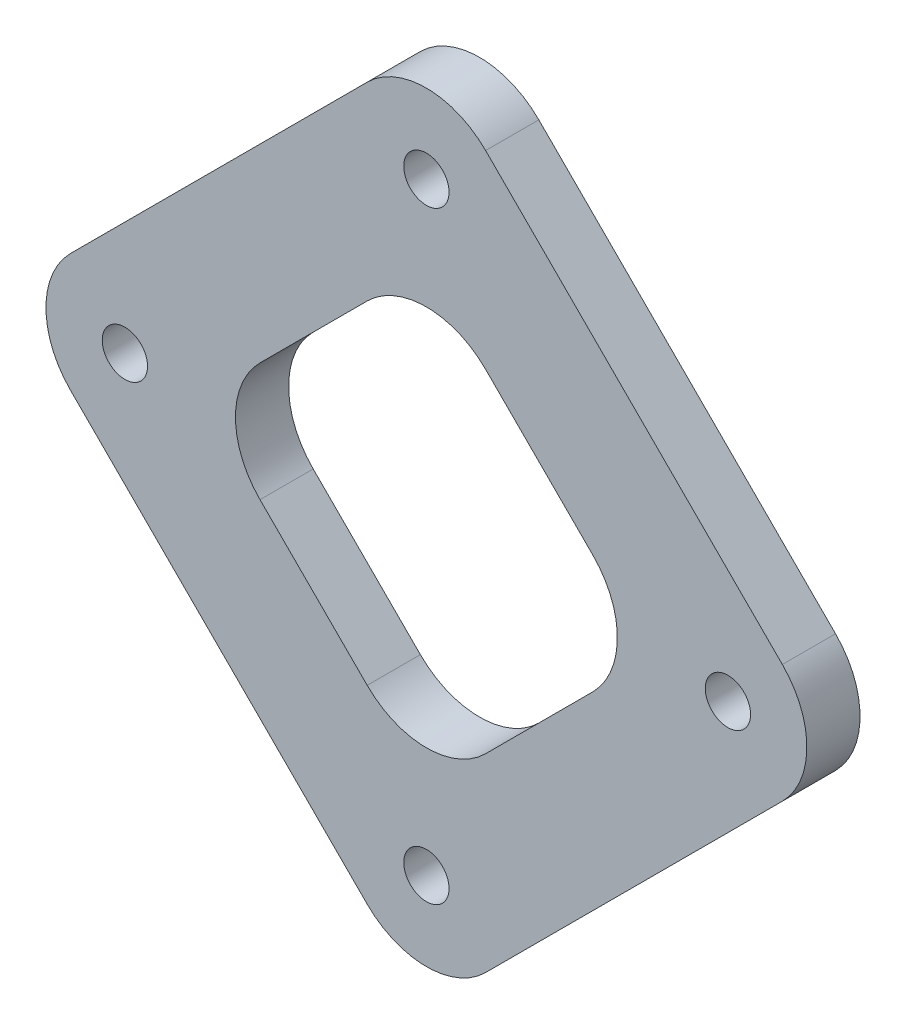
ISO-10303-21;
HEADER;
FILE_DESCRIPTION(('STEP AP214'),'2;1');
FILE_NAME('part.step','',(''),(''),'','','');
FILE_SCHEMA(('AUTOMOTIVE_DESIGN { 1 0 10303 214 1 1 1 1 }'));
ENDSEC;
DATA;
#1=APPLICATION_CONTEXT('core data for automotive mechanical design processes');
#2=APPLICATION_PROTOCOL_DEFINITION('international standard','automotive_design',2000,#1);
#3=PRODUCT_CONTEXT('',#1,'mechanical');
#4=PRODUCT('Part','Part','',(#3));
#5=PRODUCT_RELATED_PRODUCT_CATEGORY('part','',(#4));
#6=PRODUCT_DEFINITION_FORMATION('','',#4);
#7=PRODUCT_DEFINITION_CONTEXT('part definition',#1,'design');
#8=PRODUCT_DEFINITION('design','',#6,#7);
#9=PRODUCT_DEFINITION_SHAPE('','',#8);
#10=(LENGTH_UNIT() NAMED_UNIT(*) SI_UNIT(.MILLI.,.METRE.));
#11=(NAMED_UNIT(*) PLANE_ANGLE_UNIT() SI_UNIT($,.RADIAN.));
#12=(NAMED_UNIT(*) SI_UNIT($,.STERADIAN.) SOLID_ANGLE_UNIT());
#13=UNCERTAINTY_MEASURE_WITH_UNIT(LENGTH_MEASURE(1.E-05),#10,'distance_accuracy_value','');
#14=(GEOMETRIC_REPRESENTATION_CONTEXT(3) GLOBAL_UNCERTAINTY_ASSIGNED_CONTEXT((#13)) GLOBAL_UNIT_ASSIGNED_CONTEXT((#10,
#11,#12)) REPRESENTATION_CONTEXT('',''));
#15=CARTESIAN_POINT('',(0.,0.,0.));
#16=DIRECTION('',(0.,0.,1.));
#17=DIRECTION('',(1.,0.,0.));
#18=AXIS2_PLACEMENT_3D('',#15,#16,#17);
#19=CARTESIAN_POINT('',(0.,0.,3.175));
#20=DIRECTION('',(0.,0.,1.));
#21=DIRECTION('',(1.,0.,0.));
#22=AXIS2_PLACEMENT_3D('',#19,#20,#21);
#23=PLANE('',#22);
#24=CARTESIAN_POINT('',(18.,0.,3.175));
#25=DIRECTION('',(0.,0.,1.));
#26=DIRECTION('',(1.,0.,0.));
#27=AXIS2_PLACEMENT_3D('',#24,#25,#26);
#28=CIRCLE('',#27,1.35254999999999);
#29=CARTESIAN_POINT('',(19.35255,0.,3.175));
#30=VERTEX_POINT('',#29);
#31=EDGE_CURVE('E351',#30,#30,#28,.T.);
#32=ORIENTED_EDGE('',*,*,#31,.F.);
#33=EDGE_LOOP('',(#32));
#34=FACE_BOUND('',#33,.T.);
#35=CARTESIAN_POINT('',(0.,18.,3.175));
#36=DIRECTION('',(0.,0.,1.));
#37=DIRECTION('',(1.,0.,0.));
#38=AXIS2_PLACEMENT_3D('',#35,#36,#37);
#39=CIRCLE('',#38,1.35254999999999);
#40=CARTESIAN_POINT('',(1.35254999999999,18.,3.175));
#41=VERTEX_POINT('',#40);
#42=EDGE_CURVE('E212',#41,#41,#39,.T.);
#43=ORIENTED_EDGE('',*,*,#42,.F.);
#44=EDGE_LOOP('',(#43));
#45=FACE_BOUND('',#44,.T.);
#46=CARTESIAN_POINT('',(0.,-18.,3.175));
#47=DIRECTION('',(0.,0.,1.));
#48=DIRECTION('',(1.,0.,0.));
#49=AXIS2_PLACEMENT_3D('',#46,#47,#48);
#50=CIRCLE('',#49,1.35254999999999);
#51=CARTESIAN_POINT('',(1.35254999999999,-18.,3.175));
#52=VERTEX_POINT('',#51);
#53=EDGE_CURVE('E362',#52,#52,#50,.T.);
#54=ORIENTED_EDGE('',*,*,#53,.F.);
#55=EDGE_LOOP('',(#54));
#56=FACE_BOUND('',#55,.T.);
#57=CARTESIAN_POINT('',(-18.,0.,3.175));
#58=DIRECTION('',(0.,0.,1.));
#59=DIRECTION('',(1.,0.,0.));
#60=AXIS2_PLACEMENT_3D('',#57,#58,#59);
#61=CIRCLE('',#60,1.35254999999999);
#62=CARTESIAN_POINT('',(-16.64745,0.,3.175));
#63=VERTEX_POINT('',#62);
#64=EDGE_CURVE('E171',#63,#63,#61,.T.);
#65=ORIENTED_EDGE('',*,*,#64,.F.);
#66=EDGE_LOOP('',(#65));
#67=FACE_BOUND('',#66,.T.);
#68=DIRECTION('',(0.707106781186547,0.707106781186548,0.));
#69=VECTOR('',#68,1.);
#70=CARTESIAN_POINT('',(24.7840926805885,0.,3.175));
#71=LINE('',#70,#69);
#72=CARTESIAN_POINT('',(3.53553390593273,-21.2485587746558,3.175));
#73=VERTEX_POINT('',#72);
#74=CARTESIAN_POINT('',(21.2485587746557,-3.53553390593274,3.175));
#75=VERTEX_POINT('',#74);
#76=EDGE_CURVE('E180',#73,#75,#71,.T.);
#77=ORIENTED_EDGE('',*,*,#76,.T.);
#78=CARTESIAN_POINT('',(17.713024868723,0.,3.175));
#79=DIRECTION('',(0.,0.,1.));
#80=DIRECTION('',(1.,0.,0.));
#81=AXIS2_PLACEMENT_3D('',#78,#79,#80);
#82=CIRCLE('',#81,5.);
#83=CARTESIAN_POINT('',(21.2485587746558,3.53553390593273,3.175));
#84=VERTEX_POINT('',#83);
#85=EDGE_CURVE('E239',#75,#84,#82,.T.);
#86=ORIENTED_EDGE('',*,*,#85,.T.);
#87=DIRECTION('',(-0.707106781186547,0.707106781186548,0.));
#88=VECTOR('',#87,1.);
#89=CARTESIAN_POINT('',(0.,24.7840926805885,3.175));
#90=LINE('',#89,#88);
#91=CARTESIAN_POINT('',(3.53553390593274,21.2485587746558,3.175));
#92=VERTEX_POINT('',#91);
#93=EDGE_CURVE('E175',#84,#92,#90,.T.);
#94=ORIENTED_EDGE('',*,*,#93,.T.);
#95=CARTESIAN_POINT('',(0.,17.713024868723,3.175));
#96=DIRECTION('',(0.,0.,1.));
#97=DIRECTION('',(1.,0.,0.));
#98=AXIS2_PLACEMENT_3D('',#95,#96,#97);
#99=CIRCLE('',#98,5.);
#100=CARTESIAN_POINT('',(-3.53553390593274,21.2485587746558,3.175));
#101=VERTEX_POINT('',#100);
#102=EDGE_CURVE('E234',#92,#101,#99,.T.);
#103=ORIENTED_EDGE('',*,*,#102,.T.);
#104=DIRECTION('',(-0.707106781186548,-0.707106781186548,0.));
#105=VECTOR('',#104,1.);
#106=CARTESIAN_POINT('',(0.,24.7840926805885,3.175));
#107=LINE('',#106,#105);
#108=CARTESIAN_POINT('',(-21.2485587746558,3.53553390593273,3.175));
#109=VERTEX_POINT('',#108);
#110=EDGE_CURVE('E253',#101,#109,#107,.T.);
#111=ORIENTED_EDGE('',*,*,#110,.T.);
#112=CARTESIAN_POINT('',(-17.713024868723,0.,3.175));
#113=DIRECTION('',(0.,0.,1.));
#114=DIRECTION('',(1.,0.,0.));
#115=AXIS2_PLACEMENT_3D('',#112,#113,#114);
#116=CIRCLE('',#115,5.);
#117=CARTESIAN_POINT('',(-21.2485587746558,-3.53553390593274,3.175));
#118=VERTEX_POINT('',#117);
#119=EDGE_CURVE('E57',#109,#118,#116,.T.);
#120=ORIENTED_EDGE('',*,*,#119,.T.);
#121=DIRECTION('',(0.707106781186547,-0.707106781186548,0.));
#122=VECTOR('',#121,1.);
#123=CARTESIAN_POINT('',(-24.7840926805885,0.,3.175));
#124=LINE('',#123,#122);
#125=CARTESIAN_POINT('',(-3.53553390593274,-21.2485587746558,3.175));
#126=VERTEX_POINT('',#125);
#127=EDGE_CURVE('E275',#118,#126,#124,.T.);
#128=ORIENTED_EDGE('',*,*,#127,.T.);
#129=CARTESIAN_POINT('',(0.,-17.713024868723,3.175));
#130=DIRECTION('',(0.,0.,1.));
#131=DIRECTION('',(1.,0.,0.));
#132=AXIS2_PLACEMENT_3D('',#129,#130,#131);
#133=CIRCLE('',#132,5.);
#134=EDGE_CURVE('E237',#126,#73,#133,.T.);
#135=ORIENTED_EDGE('',*,*,#134,.T.);
#136=EDGE_LOOP('',(#77,#86,#94,#103,#111,#120,#128,#135));
#137=FACE_BOUND('',#136,.T.);
#138=DIRECTION('',(0.707106781186547,-0.707106781186548,0.));
#139=VECTOR('',#138,1.);
#140=CARTESIAN_POINT('',(-13.4703841816037,0.,3.175));
#141=LINE('',#140,#139);
#142=CARTESIAN_POINT('',(-9.93485027567099,-3.53553390593274,3.175));
#143=VERTEX_POINT('',#142);
#144=CARTESIAN_POINT('',(-3.53553390593274,-9.934850275671,3.175));
#145=VERTEX_POINT('',#144);
#146=EDGE_CURVE('E372',#143,#145,#141,.T.);
#147=ORIENTED_EDGE('',*,*,#146,.F.);
#148=CARTESIAN_POINT('',(-6.39931636973826,0.,3.175));
#149=DIRECTION('',(0.,0.,1.));
#150=DIRECTION('',(1.,0.,0.));
#151=AXIS2_PLACEMENT_3D('',#148,#149,#150);
#152=CIRCLE('',#151,5.);
#153=CARTESIAN_POINT('',(-9.93485027567099,3.53553390593274,3.175));
#154=VERTEX_POINT('',#153);
#155=EDGE_CURVE('E201',#143,#154,#152,.F.);
#156=ORIENTED_EDGE('',*,*,#155,.T.);
#157=DIRECTION('',(-0.707106781186547,-0.707106781186547,0.));
#158=VECTOR('',#157,1.);
#159=CARTESIAN_POINT('',(0.,13.4703841816037,3.175));
#160=LINE('',#159,#158);
#161=CARTESIAN_POINT('',(-3.53553390593274,9.93485027567099,3.175));
#162=VERTEX_POINT('',#161);
#163=EDGE_CURVE('E370',#162,#154,#160,.T.);
#164=ORIENTED_EDGE('',*,*,#163,.F.);
#165=CARTESIAN_POINT('',(0.,6.39931636973825,3.175));
#166=DIRECTION('',(0.,0.,1.));
#167=DIRECTION('',(1.,0.,0.));
#168=AXIS2_PLACEMENT_3D('',#165,#166,#167);
#169=CIRCLE('',#168,5.);
#170=CARTESIAN_POINT('',(3.53553390593274,9.93485027567099,3.175));
#171=VERTEX_POINT('',#170);
#172=EDGE_CURVE('E159',#162,#171,#169,.F.);
#173=ORIENTED_EDGE('',*,*,#172,.T.);
#174=DIRECTION('',(-0.707106781186547,0.707106781186548,0.));
#175=VECTOR('',#174,1.);
#176=CARTESIAN_POINT('',(0.,13.4703841816037,3.175));
#177=LINE('',#176,#175);
#178=CARTESIAN_POINT('',(9.93485027567099,3.53553390593274,3.175));
#179=VERTEX_POINT('',#178);
#180=EDGE_CURVE('E261',#179,#171,#177,.T.);
#181=ORIENTED_EDGE('',*,*,#180,.F.);
#182=CARTESIAN_POINT('',(6.39931636973825,0.,3.175));
#183=DIRECTION('',(0.,0.,1.));
#184=DIRECTION('',(1.,0.,0.));
#185=AXIS2_PLACEMENT_3D('',#182,#183,#184);
#186=CIRCLE('',#185,5.);
#187=CARTESIAN_POINT('',(9.93485027567099,-3.53553390593274,3.175));
#188=VERTEX_POINT('',#187);
#189=EDGE_CURVE('E160',#179,#188,#186,.F.);
#190=ORIENTED_EDGE('',*,*,#189,.T.);
#191=DIRECTION('',(0.707106781186547,0.707106781186548,0.));
#192=VECTOR('',#191,1.);
#193=CARTESIAN_POINT('',(13.4703841816037,0.,3.175));
#194=LINE('',#193,#192);
#195=CARTESIAN_POINT('',(3.53553390593274,-9.93485027567099,3.175));
#196=VERTEX_POINT('',#195);
#197=EDGE_CURVE('E266',#196,#188,#194,.T.);
#198=ORIENTED_EDGE('',*,*,#197,.F.);
#199=CARTESIAN_POINT('',(0.,-6.39931636973826,3.175));
#200=DIRECTION('',(0.,0.,1.));
#201=DIRECTION('',(1.,0.,0.));
#202=AXIS2_PLACEMENT_3D('',#199,#200,#201);
#203=CIRCLE('',#202,5.);
#204=EDGE_CURVE('E205',#196,#145,#203,.F.);
#205=ORIENTED_EDGE('',*,*,#204,.T.);
#206=EDGE_LOOP('',(#147,#156,#164,#173,#181,#190,#198,#205));
#207=FACE_BOUND('',#206,.T.);
#208=ADVANCED_FACE('F35',(#34,#45,#56,#67,#137,#207),#23,.T.);
#209=CARTESIAN_POINT('',(0.,0.,0.));
#210=DIRECTION('',(0.,0.,1.));
#211=DIRECTION('',(1.,0.,0.));
#212=AXIS2_PLACEMENT_3D('',#209,#210,#211);
#213=PLANE('',#212);
#214=CARTESIAN_POINT('',(18.,0.,0.));
#215=DIRECTION('',(0.,0.,-1.));
#216=DIRECTION('',(-1.,0.,0.));
#217=AXIS2_PLACEMENT_3D('',#214,#215,#216);
#218=CIRCLE('',#217,1.35254999999999);
#219=CARTESIAN_POINT('',(16.64745,0.,0.));
#220=VERTEX_POINT('',#219);
#221=EDGE_CURVE('E354',#220,#220,#218,.T.);
#222=ORIENTED_EDGE('',*,*,#221,.F.);
#223=EDGE_LOOP('',(#222));
#224=FACE_BOUND('',#223,.T.);
#225=CARTESIAN_POINT('',(0.,18.,0.));
#226=DIRECTION('',(0.,0.,-1.));
#227=DIRECTION('',(-1.,0.,0.));
#228=AXIS2_PLACEMENT_3D('',#225,#226,#227);
#229=CIRCLE('',#228,1.35254999999999);
#230=CARTESIAN_POINT('',(-1.35254999999999,18.,0.));
#231=VERTEX_POINT('',#230);
#232=EDGE_CURVE('E216',#231,#231,#229,.T.);
#233=ORIENTED_EDGE('',*,*,#232,.F.);
#234=EDGE_LOOP('',(#233));
#235=FACE_BOUND('',#234,.T.);
#236=CARTESIAN_POINT('',(0.,-18.,0.));
#237=DIRECTION('',(0.,0.,-1.));
#238=DIRECTION('',(-1.,0.,0.));
#239=AXIS2_PLACEMENT_3D('',#236,#237,#238);
#240=CIRCLE('',#239,1.35254999999999);
#241=CARTESIAN_POINT('',(-1.35254999999999,-18.,0.));
#242=VERTEX_POINT('',#241);
#243=EDGE_CURVE('E215',#242,#242,#240,.T.);
#244=ORIENTED_EDGE('',*,*,#243,.F.);
#245=EDGE_LOOP('',(#244));
#246=FACE_BOUND('',#245,.T.);
#247=CARTESIAN_POINT('',(-18.,0.,0.));
#248=DIRECTION('',(0.,0.,-1.));
#249=DIRECTION('',(-1.,0.,0.));
#250=AXIS2_PLACEMENT_3D('',#247,#248,#249);
#251=CIRCLE('',#250,1.35254999999999);
#252=CARTESIAN_POINT('',(-19.35255,0.,0.));
#253=VERTEX_POINT('',#252);
#254=EDGE_CURVE('E365',#253,#253,#251,.T.);
#255=ORIENTED_EDGE('',*,*,#254,.F.);
#256=EDGE_LOOP('',(#255));
#257=FACE_BOUND('',#256,.T.);
#258=DIRECTION('',(-0.707106781186547,0.707106781186548,0.));
#259=VECTOR('',#258,1.);
#260=CARTESIAN_POINT('',(0.,24.7840926805885,0.));
#261=LINE('',#260,#259);
#262=CARTESIAN_POINT('',(21.2485587746558,3.53553390593273,0.));
#263=VERTEX_POINT('',#262);
#264=CARTESIAN_POINT('',(3.53553390593274,21.2485587746558,0.));
#265=VERTEX_POINT('',#264);
#266=EDGE_CURVE('E183',#263,#265,#261,.T.);
#267=ORIENTED_EDGE('',*,*,#266,.F.);
#268=CARTESIAN_POINT('',(17.713024868723,0.,0.));
#269=DIRECTION('',(0.,0.,1.));
#270=DIRECTION('',(1.,0.,0.));
#271=AXIS2_PLACEMENT_3D('',#268,#269,#270);
#272=CIRCLE('',#271,5.);
#273=CARTESIAN_POINT('',(21.2485587746557,-3.53553390593274,0.));
#274=VERTEX_POINT('',#273);
#275=EDGE_CURVE('E227',#263,#274,#272,.F.);
#276=ORIENTED_EDGE('',*,*,#275,.T.);
#277=DIRECTION('',(0.707106781186547,0.707106781186548,0.));
#278=VECTOR('',#277,1.);
#279=CARTESIAN_POINT('',(24.7840926805885,0.,0.));
#280=LINE('',#279,#278);
#281=CARTESIAN_POINT('',(3.53553390593273,-21.2485587746558,0.));
#282=VERTEX_POINT('',#281);
#283=EDGE_CURVE('E263',#282,#274,#280,.T.);
#284=ORIENTED_EDGE('',*,*,#283,.F.);
#285=CARTESIAN_POINT('',(0.,-17.713024868723,0.));
#286=DIRECTION('',(0.,0.,1.));
#287=DIRECTION('',(1.,0.,0.));
#288=AXIS2_PLACEMENT_3D('',#285,#286,#287);
#289=CIRCLE('',#288,5.);
#290=CARTESIAN_POINT('',(-3.53553390593274,-21.2485587746558,0.));
#291=VERTEX_POINT('',#290);
#292=EDGE_CURVE('E225',#282,#291,#289,.F.);
#293=ORIENTED_EDGE('',*,*,#292,.T.);
#294=DIRECTION('',(0.707106781186547,-0.707106781186548,0.));
#295=VECTOR('',#294,1.);
#296=CARTESIAN_POINT('',(-24.7840926805885,0.,0.));
#297=LINE('',#296,#295);
#298=CARTESIAN_POINT('',(-21.2485587746558,-3.53553390593274,0.));
#299=VERTEX_POINT('',#298);
#300=EDGE_CURVE('E260',#299,#291,#297,.T.);
#301=ORIENTED_EDGE('',*,*,#300,.F.);
#302=CARTESIAN_POINT('',(-17.713024868723,0.,0.));
#303=DIRECTION('',(0.,0.,1.));
#304=DIRECTION('',(1.,0.,0.));
#305=AXIS2_PLACEMENT_3D('',#302,#303,#304);
#306=CIRCLE('',#305,5.);
#307=CARTESIAN_POINT('',(-21.2485587746558,3.53553390593273,0.));
#308=VERTEX_POINT('',#307);
#309=EDGE_CURVE('E223',#299,#308,#306,.F.);
#310=ORIENTED_EDGE('',*,*,#309,.T.);
#311=DIRECTION('',(-0.707106781186548,-0.707106781186548,0.));
#312=VECTOR('',#311,1.);
#313=CARTESIAN_POINT('',(0.,24.7840926805885,0.));
#314=LINE('',#313,#312);
#315=CARTESIAN_POINT('',(-3.53553390593274,21.2485587746558,0.));
#316=VERTEX_POINT('',#315);
#317=EDGE_CURVE('E251',#316,#308,#314,.T.);
#318=ORIENTED_EDGE('',*,*,#317,.F.);
#319=CARTESIAN_POINT('',(0.,17.713024868723,0.));
#320=DIRECTION('',(0.,0.,1.));
#321=DIRECTION('',(1.,0.,0.));
#322=AXIS2_PLACEMENT_3D('',#319,#320,#321);
#323=CIRCLE('',#322,5.);
#324=EDGE_CURVE('E221',#316,#265,#323,.F.);
#325=ORIENTED_EDGE('',*,*,#324,.T.);
#326=EDGE_LOOP('',(#267,#276,#284,#293,#301,#310,#318,#325));
#327=FACE_BOUND('',#326,.T.);
#328=DIRECTION('',(-0.707106781186547,0.707106781186548,0.));
#329=VECTOR('',#328,1.);
#330=CARTESIAN_POINT('',(0.,13.4703841816037,0.));
#331=LINE('',#330,#329);
#332=CARTESIAN_POINT('',(9.93485027567099,3.53553390593274,0.));
#333=VERTEX_POINT('',#332);
#334=CARTESIAN_POINT('',(3.53553390593274,9.93485027567099,0.));
#335=VERTEX_POINT('',#334);
#336=EDGE_CURVE('E154',#333,#335,#331,.T.);
#337=ORIENTED_EDGE('',*,*,#336,.T.);
#338=CARTESIAN_POINT('',(0.,6.39931636973825,0.));
#339=DIRECTION('',(0.,0.,1.));
#340=DIRECTION('',(1.,0.,0.));
#341=AXIS2_PLACEMENT_3D('',#338,#339,#340);
#342=CIRCLE('',#341,5.);
#343=CARTESIAN_POINT('',(-3.53553390593274,9.93485027567099,0.));
#344=VERTEX_POINT('',#343);
#345=EDGE_CURVE('E149',#335,#344,#342,.T.);
#346=ORIENTED_EDGE('',*,*,#345,.T.);
#347=DIRECTION('',(-0.707106781186547,-0.707106781186547,0.));
#348=VECTOR('',#347,1.);
#349=CARTESIAN_POINT('',(0.,13.4703841816037,0.));
#350=LINE('',#349,#348);
#351=CARTESIAN_POINT('',(-9.93485027567099,3.53553390593274,0.));
#352=VERTEX_POINT('',#351);
#353=EDGE_CURVE('E152',#344,#352,#350,.T.);
#354=ORIENTED_EDGE('',*,*,#353,.T.);
#355=CARTESIAN_POINT('',(-6.39931636973826,0.,0.));
#356=DIRECTION('',(0.,0.,1.));
#357=DIRECTION('',(1.,0.,0.));
#358=AXIS2_PLACEMENT_3D('',#355,#356,#357);
#359=CIRCLE('',#358,5.);
#360=CARTESIAN_POINT('',(-9.93485027567099,-3.53553390593274,0.));
#361=VERTEX_POINT('',#360);
#362=EDGE_CURVE('E199',#352,#361,#359,.T.);
#363=ORIENTED_EDGE('',*,*,#362,.T.);
#364=DIRECTION('',(0.707106781186547,-0.707106781186548,0.));
#365=VECTOR('',#364,1.);
#366=CARTESIAN_POINT('',(-13.4703841816037,0.,0.));
#367=LINE('',#366,#365);
#368=CARTESIAN_POINT('',(-3.53553390593274,-9.934850275671,0.));
#369=VERTEX_POINT('',#368);
#370=EDGE_CURVE('E170',#361,#369,#367,.T.);
#371=ORIENTED_EDGE('',*,*,#370,.T.);
#372=CARTESIAN_POINT('',(0.,-6.39931636973826,0.));
#373=DIRECTION('',(0.,0.,1.));
#374=DIRECTION('',(1.,0.,0.));
#375=AXIS2_PLACEMENT_3D('',#372,#373,#374);
#376=CIRCLE('',#375,5.);
#377=CARTESIAN_POINT('',(3.53553390593274,-9.93485027567099,0.));
#378=VERTEX_POINT('',#377);
#379=EDGE_CURVE('E203',#369,#378,#376,.T.);
#380=ORIENTED_EDGE('',*,*,#379,.T.);
#381=DIRECTION('',(0.707106781186547,0.707106781186548,0.));
#382=VECTOR('',#381,1.);
#383=CARTESIAN_POINT('',(13.4703841816037,0.,0.));
#384=LINE('',#383,#382);
#385=CARTESIAN_POINT('',(9.93485027567099,-3.53553390593274,0.));
#386=VERTEX_POINT('',#385);
#387=EDGE_CURVE('E378',#378,#386,#384,.T.);
#388=ORIENTED_EDGE('',*,*,#387,.T.);
#389=CARTESIAN_POINT('',(6.39931636973825,0.,0.));
#390=DIRECTION('',(0.,0.,1.));
#391=DIRECTION('',(1.,0.,0.));
#392=AXIS2_PLACEMENT_3D('',#389,#390,#391);
#393=CIRCLE('',#392,5.);
#394=EDGE_CURVE('E207',#386,#333,#393,.T.);
#395=ORIENTED_EDGE('',*,*,#394,.T.);
#396=EDGE_LOOP('',(#337,#346,#354,#363,#371,#380,#388,#395));
#397=FACE_BOUND('',#396,.T.);
#398=ADVANCED_FACE('F151',(#224,#235,#246,#257,#327,#397),#213,.F.);
#399=CARTESIAN_POINT('',(0.,24.7840926805885,3.175));
#400=DIRECTION('',(0.707106781186548,-0.707106781186548,0.));
#401=DIRECTION('',(0.707106781186548,0.707106781186548,0.));
#402=AXIS2_PLACEMENT_3D('',#399,#400,#401);
#403=PLANE('',#402);
#404=ORIENTED_EDGE('',*,*,#317,.T.);
#405=DIRECTION('',(0.,0.,-1.));
#406=VECTOR('',#405,1.);
#407=CARTESIAN_POINT('',(-21.2485587746558,3.53553390593274,3.175));
#408=LINE('',#407,#406);
#409=EDGE_CURVE('E11',#308,#109,#408,.F.);
#410=ORIENTED_EDGE('',*,*,#409,.T.);
#411=ORIENTED_EDGE('',*,*,#110,.F.);
#412=DIRECTION('',(0.,0.,-1.));
#413=VECTOR('',#412,1.);
#414=CARTESIAN_POINT('',(-3.53553390593274,21.2485587746558,3.175));
#415=LINE('',#414,#413);
#416=EDGE_CURVE('E43',#101,#316,#415,.T.);
#417=ORIENTED_EDGE('',*,*,#416,.T.);
#418=EDGE_LOOP('',(#404,#410,#411,#417));
#419=FACE_BOUND('',#418,.T.);
#420=ADVANCED_FACE('F250',(#419),#403,.F.);
#421=CARTESIAN_POINT('',(-24.7840926805885,0.,3.175));
#422=DIRECTION('',(0.707106781186548,0.707106781186547,0.));
#423=DIRECTION('',(-0.707106781186547,0.707106781186548,0.));
#424=AXIS2_PLACEMENT_3D('',#421,#422,#423);
#425=PLANE('',#424);
#426=ORIENTED_EDGE('',*,*,#300,.T.);
#427=DIRECTION('',(0.,0.,-1.));
#428=VECTOR('',#427,1.);
#429=CARTESIAN_POINT('',(-3.53553390593274,-21.2485587746558,3.175));
#430=LINE('',#429,#428);
#431=EDGE_CURVE('E50',#291,#126,#430,.F.);
#432=ORIENTED_EDGE('',*,*,#431,.T.);
#433=ORIENTED_EDGE('',*,*,#127,.F.);
#434=DIRECTION('',(0.,0.,-1.));
#435=VECTOR('',#434,1.);
#436=CARTESIAN_POINT('',(-21.2485587746558,-3.53553390593274,3.175));
#437=LINE('',#436,#435);
#438=EDGE_CURVE('E241',#118,#299,#437,.T.);
#439=ORIENTED_EDGE('',*,*,#438,.T.);
#440=EDGE_LOOP('',(#426,#432,#433,#439));
#441=FACE_BOUND('',#440,.T.);
#442=ADVANCED_FACE('F292',(#441),#425,.F.);
#443=CARTESIAN_POINT('',(24.7840926805885,0.,3.175));
#444=DIRECTION('',(-0.707106781186548,0.707106781186547,0.));
#445=DIRECTION('',(-0.707106781186547,-0.707106781186548,0.));
#446=AXIS2_PLACEMENT_3D('',#443,#444,#445);
#447=PLANE('',#446);
#448=ORIENTED_EDGE('',*,*,#283,.T.);
#449=DIRECTION('',(0.,0.,-1.));
#450=VECTOR('',#449,1.);
#451=CARTESIAN_POINT('',(21.2485587746557,-3.53553390593274,3.175));
#452=LINE('',#451,#450);
#453=EDGE_CURVE('E232',#274,#75,#452,.F.);
#454=ORIENTED_EDGE('',*,*,#453,.T.);
#455=ORIENTED_EDGE('',*,*,#76,.F.);
#456=DIRECTION('',(0.,0.,-1.));
#457=VECTOR('',#456,1.);
#458=CARTESIAN_POINT('',(3.53553390593274,-21.2485587746558,3.175));
#459=LINE('',#458,#457);
#460=EDGE_CURVE('E229',#73,#282,#459,.T.);
#461=ORIENTED_EDGE('',*,*,#460,.T.);
#462=EDGE_LOOP('',(#448,#454,#455,#461));
#463=FACE_BOUND('',#462,.T.);
#464=ADVANCED_FACE('F295',(#463),#447,.F.);
#465=CARTESIAN_POINT('',(0.,24.7840926805885,3.175));
#466=DIRECTION('',(-0.707106781186548,-0.707106781186547,0.));
#467=DIRECTION('',(0.707106781186547,-0.707106781186548,0.));
#468=AXIS2_PLACEMENT_3D('',#465,#466,#467);
#469=PLANE('',#468);
#470=ORIENTED_EDGE('',*,*,#93,.F.);
#471=DIRECTION('',(0.,0.,-1.));
#472=VECTOR('',#471,1.);
#473=CARTESIAN_POINT('',(21.2485587746558,3.53553390593273,3.175));
#474=LINE('',#473,#472);
#475=EDGE_CURVE('E218',#84,#263,#474,.T.);
#476=ORIENTED_EDGE('',*,*,#475,.T.);
#477=ORIENTED_EDGE('',*,*,#266,.T.);
#478=DIRECTION('',(0.,0.,-1.));
#479=VECTOR('',#478,1.);
#480=CARTESIAN_POINT('',(3.53553390593274,21.2485587746558,3.175));
#481=LINE('',#480,#479);
#482=EDGE_CURVE('E211',#265,#92,#481,.F.);
#483=ORIENTED_EDGE('',*,*,#482,.T.);
#484=EDGE_LOOP('',(#470,#476,#477,#483));
#485=FACE_BOUND('',#484,.T.);
#486=ADVANCED_FACE('F290',(#485),#469,.F.);
#487=CARTESIAN_POINT('',(0.,13.4703841816037,3.175));
#488=DIRECTION('',(0.707106781186548,-0.707106781186548,0.));
#489=DIRECTION('',(0.707106781186548,0.707106781186548,0.));
#490=AXIS2_PLACEMENT_3D('',#487,#488,#489);
#491=PLANE('',#490);
#492=ORIENTED_EDGE('',*,*,#163,.T.);
#493=DIRECTION('',(0.,0.,-1.));
#494=VECTOR('',#493,1.);
#495=CARTESIAN_POINT('',(-9.934850275671,3.53553390593274,0.));
#496=LINE('',#495,#494);
#497=EDGE_CURVE('E169',#154,#352,#496,.T.);
#498=ORIENTED_EDGE('',*,*,#497,.T.);
#499=ORIENTED_EDGE('',*,*,#353,.F.);
#500=DIRECTION('',(0.,0.,-1.));
#501=VECTOR('',#500,1.);
#502=CARTESIAN_POINT('',(-3.53553390593274,9.93485027567099,3.175));
#503=LINE('',#502,#501);
#504=EDGE_CURVE('E166',#344,#162,#503,.F.);
#505=ORIENTED_EDGE('',*,*,#504,.T.);
#506=EDGE_LOOP('',(#492,#498,#499,#505));
#507=FACE_BOUND('',#506,.T.);
#508=ADVANCED_FACE('F165',(#507),#491,.T.);
#509=CARTESIAN_POINT('',(-13.4703841816037,0.,3.175));
#510=DIRECTION('',(0.707106781186548,0.707106781186547,0.));
#511=DIRECTION('',(-0.707106781186547,0.707106781186548,0.));
#512=AXIS2_PLACEMENT_3D('',#509,#510,#511);
#513=PLANE('',#512);
#514=ORIENTED_EDGE('',*,*,#370,.F.);
#515=DIRECTION('',(0.,0.,-1.));
#516=VECTOR('',#515,1.);
#517=CARTESIAN_POINT('',(-9.934850275671,-3.53553390593274,3.175));
#518=LINE('',#517,#516);
#519=EDGE_CURVE('E188',#361,#143,#518,.F.);
#520=ORIENTED_EDGE('',*,*,#519,.T.);
#521=ORIENTED_EDGE('',*,*,#146,.T.);
#522=DIRECTION('',(0.,0.,-1.));
#523=VECTOR('',#522,1.);
#524=CARTESIAN_POINT('',(-3.53553390593274,-9.93485027567099,0.));
#525=LINE('',#524,#523);
#526=EDGE_CURVE('E177',#145,#369,#525,.T.);
#527=ORIENTED_EDGE('',*,*,#526,.T.);
#528=EDGE_LOOP('',(#514,#520,#521,#527));
#529=FACE_BOUND('',#528,.T.);
#530=ADVANCED_FACE('F317',(#529),#513,.T.);
#531=CARTESIAN_POINT('',(13.4703841816037,0.,3.175));
#532=DIRECTION('',(-0.707106781186548,0.707106781186547,0.));
#533=DIRECTION('',(-0.707106781186547,-0.707106781186548,0.));
#534=AXIS2_PLACEMENT_3D('',#531,#532,#533);
#535=PLANE('',#534);
#536=ORIENTED_EDGE('',*,*,#387,.F.);
#537=DIRECTION('',(0.,0.,-1.));
#538=VECTOR('',#537,1.);
#539=CARTESIAN_POINT('',(3.53553390593273,-9.93485027567099,3.175));
#540=LINE('',#539,#538);
#541=EDGE_CURVE('E193',#378,#196,#540,.F.);
#542=ORIENTED_EDGE('',*,*,#541,.T.);
#543=ORIENTED_EDGE('',*,*,#197,.T.);
#544=DIRECTION('',(0.,0.,-1.));
#545=VECTOR('',#544,1.);
#546=CARTESIAN_POINT('',(9.93485027567099,-3.53553390593274,0.));
#547=LINE('',#546,#545);
#548=EDGE_CURVE('E190',#188,#386,#547,.T.);
#549=ORIENTED_EDGE('',*,*,#548,.T.);
#550=EDGE_LOOP('',(#536,#542,#543,#549));
#551=FACE_BOUND('',#550,.T.);
#552=ADVANCED_FACE('F320',(#551),#535,.T.);
#553=CARTESIAN_POINT('',(0.,13.4703841816037,3.175));
#554=DIRECTION('',(-0.707106781186548,-0.707106781186547,0.));
#555=DIRECTION('',(0.707106781186547,-0.707106781186548,0.));
#556=AXIS2_PLACEMENT_3D('',#553,#554,#555);
#557=PLANE('',#556);
#558=ORIENTED_EDGE('',*,*,#336,.F.);
#559=DIRECTION('',(0.,0.,-1.));
#560=VECTOR('',#559,1.);
#561=CARTESIAN_POINT('',(9.93485027567099,3.53553390593274,3.175));
#562=LINE('',#561,#560);
#563=EDGE_CURVE('E197',#333,#179,#562,.F.);
#564=ORIENTED_EDGE('',*,*,#563,.T.);
#565=ORIENTED_EDGE('',*,*,#180,.T.);
#566=DIRECTION('',(0.,0.,-1.));
#567=VECTOR('',#566,1.);
#568=CARTESIAN_POINT('',(3.53553390593274,9.93485027567099,0.));
#569=LINE('',#568,#567);
#570=EDGE_CURVE('E195',#171,#335,#569,.T.);
#571=ORIENTED_EDGE('',*,*,#570,.T.);
#572=EDGE_LOOP('',(#558,#564,#565,#571));
#573=FACE_BOUND('',#572,.T.);
#574=ADVANCED_FACE('F324',(#573),#557,.T.);
#575=CARTESIAN_POINT('',(-6.39931636973826,0.,3.175));
#576=DIRECTION('',(0.,0.,1.));
#577=DIRECTION('',(1.,0.,0.));
#578=AXIS2_PLACEMENT_3D('',#575,#576,#577);
#579=CYLINDRICAL_SURFACE('',#578,5.);
#580=ORIENTED_EDGE('',*,*,#155,.F.);
#581=ORIENTED_EDGE('',*,*,#519,.F.);
#582=ORIENTED_EDGE('',*,*,#362,.F.);
#583=ORIENTED_EDGE('',*,*,#497,.F.);
#584=EDGE_LOOP('',(#580,#581,#582,#583));
#585=FACE_BOUND('',#584,.T.);
#586=ADVANCED_FACE('F328',(#585),#579,.F.);
#587=CARTESIAN_POINT('',(0.,-6.39931636973826,3.175));
#588=DIRECTION('',(0.,0.,1.));
#589=DIRECTION('',(1.,0.,0.));
#590=AXIS2_PLACEMENT_3D('',#587,#588,#589);
#591=CYLINDRICAL_SURFACE('',#590,5.);
#592=ORIENTED_EDGE('',*,*,#204,.F.);
#593=ORIENTED_EDGE('',*,*,#541,.F.);
#594=ORIENTED_EDGE('',*,*,#379,.F.);
#595=ORIENTED_EDGE('',*,*,#526,.F.);
#596=EDGE_LOOP('',(#592,#593,#594,#595));
#597=FACE_BOUND('',#596,.T.);
#598=ADVANCED_FACE('F386',(#597),#591,.F.);
#599=CARTESIAN_POINT('',(6.39931636973825,0.,3.175));
#600=DIRECTION('',(0.,0.,1.));
#601=DIRECTION('',(1.,0.,0.));
#602=AXIS2_PLACEMENT_3D('',#599,#600,#601);
#603=CYLINDRICAL_SURFACE('',#602,5.);
#604=ORIENTED_EDGE('',*,*,#189,.F.);
#605=ORIENTED_EDGE('',*,*,#563,.F.);
#606=ORIENTED_EDGE('',*,*,#394,.F.);
#607=ORIENTED_EDGE('',*,*,#548,.F.);
#608=EDGE_LOOP('',(#604,#605,#606,#607));
#609=FACE_BOUND('',#608,.T.);
#610=ADVANCED_FACE('F397',(#609),#603,.F.);
#611=CARTESIAN_POINT('',(0.,6.39931636973825,3.175));
#612=DIRECTION('',(0.,0.,1.));
#613=DIRECTION('',(1.,0.,0.));
#614=AXIS2_PLACEMENT_3D('',#611,#612,#613);
#615=CYLINDRICAL_SURFACE('',#614,5.);
#616=ORIENTED_EDGE('',*,*,#172,.F.);
#617=ORIENTED_EDGE('',*,*,#504,.F.);
#618=ORIENTED_EDGE('',*,*,#345,.F.);
#619=ORIENTED_EDGE('',*,*,#570,.F.);
#620=EDGE_LOOP('',(#616,#617,#618,#619));
#621=FACE_BOUND('',#620,.T.);
#622=ADVANCED_FACE('F174',(#621),#615,.F.);
#623=CARTESIAN_POINT('',(-18.,0.,0.));
#624=DIRECTION('',(0.,0.,-1.));
#625=DIRECTION('',(-1.,0.,0.));
#626=AXIS2_PLACEMENT_3D('',#623,#624,#625);
#627=CYLINDRICAL_SURFACE('',#626,1.35254999999999);
#628=ORIENTED_EDGE('',*,*,#64,.T.);
#629=EDGE_LOOP('',(#628));
#630=FACE_BOUND('',#629,.T.);
#631=ORIENTED_EDGE('',*,*,#254,.T.);
#632=EDGE_LOOP('',(#631));
#633=FACE_BOUND('',#632,.T.);
#634=ADVANCED_FACE('F330',(#630,#633),#627,.F.);
#635=CARTESIAN_POINT('',(0.,-18.,0.));
#636=DIRECTION('',(0.,0.,-1.));
#637=DIRECTION('',(-1.,0.,0.));
#638=AXIS2_PLACEMENT_3D('',#635,#636,#637);
#639=CYLINDRICAL_SURFACE('',#638,1.35254999999999);
#640=ORIENTED_EDGE('',*,*,#53,.T.);
#641=EDGE_LOOP('',(#640));
#642=FACE_BOUND('',#641,.T.);
#643=ORIENTED_EDGE('',*,*,#243,.T.);
#644=EDGE_LOOP('',(#643));
#645=FACE_BOUND('',#644,.T.);
#646=ADVANCED_FACE('F333',(#642,#645),#639,.F.);
#647=CARTESIAN_POINT('',(0.,18.,0.));
#648=DIRECTION('',(0.,0.,-1.));
#649=DIRECTION('',(-1.,0.,0.));
#650=AXIS2_PLACEMENT_3D('',#647,#648,#649);
#651=CYLINDRICAL_SURFACE('',#650,1.35254999999999);
#652=ORIENTED_EDGE('',*,*,#42,.T.);
#653=EDGE_LOOP('',(#652));
#654=FACE_BOUND('',#653,.T.);
#655=ORIENTED_EDGE('',*,*,#232,.T.);
#656=EDGE_LOOP('',(#655));
#657=FACE_BOUND('',#656,.T.);
#658=ADVANCED_FACE('F337',(#654,#657),#651,.F.);
#659=CARTESIAN_POINT('',(18.,0.,0.));
#660=DIRECTION('',(0.,0.,-1.));
#661=DIRECTION('',(-1.,0.,0.));
#662=AXIS2_PLACEMENT_3D('',#659,#660,#661);
#663=CYLINDRICAL_SURFACE('',#662,1.35254999999999);
#664=ORIENTED_EDGE('',*,*,#31,.T.);
#665=EDGE_LOOP('',(#664));
#666=FACE_BOUND('',#665,.T.);
#667=ORIENTED_EDGE('',*,*,#221,.T.);
#668=EDGE_LOOP('',(#667));
#669=FACE_BOUND('',#668,.T.);
#670=ADVANCED_FACE('F341',(#666,#669),#663,.F.);
#671=CARTESIAN_POINT('',(17.713024868723,0.,3.175));
#672=DIRECTION('',(0.,0.,-1.));
#673=DIRECTION('',(-1.,0.,0.));
#674=AXIS2_PLACEMENT_3D('',#671,#672,#673);
#675=CYLINDRICAL_SURFACE('',#674,5.);
#676=ORIENTED_EDGE('',*,*,#85,.F.);
#677=ORIENTED_EDGE('',*,*,#453,.F.);
#678=ORIENTED_EDGE('',*,*,#275,.F.);
#679=ORIENTED_EDGE('',*,*,#475,.F.);
#680=EDGE_LOOP('',(#676,#677,#678,#679));
#681=FACE_BOUND('',#680,.T.);
#682=ADVANCED_FACE('F289',(#681),#675,.T.);
#683=CARTESIAN_POINT('',(0.,-17.713024868723,3.175));
#684=DIRECTION('',(0.,0.,-1.));
#685=DIRECTION('',(-1.,0.,0.));
#686=AXIS2_PLACEMENT_3D('',#683,#684,#685);
#687=CYLINDRICAL_SURFACE('',#686,5.);
#688=ORIENTED_EDGE('',*,*,#134,.F.);
#689=ORIENTED_EDGE('',*,*,#431,.F.);
#690=ORIENTED_EDGE('',*,*,#292,.F.);
#691=ORIENTED_EDGE('',*,*,#460,.F.);
#692=EDGE_LOOP('',(#688,#689,#690,#691));
#693=FACE_BOUND('',#692,.T.);
#694=ADVANCED_FACE('F294',(#693),#687,.T.);
#695=CARTESIAN_POINT('',(-17.713024868723,0.,3.175));
#696=DIRECTION('',(0.,0.,-1.));
#697=DIRECTION('',(-1.,0.,0.));
#698=AXIS2_PLACEMENT_3D('',#695,#696,#697);
#699=CYLINDRICAL_SURFACE('',#698,5.);
#700=ORIENTED_EDGE('',*,*,#119,.F.);
#701=ORIENTED_EDGE('',*,*,#409,.F.);
#702=ORIENTED_EDGE('',*,*,#309,.F.);
#703=ORIENTED_EDGE('',*,*,#438,.F.);
#704=EDGE_LOOP('',(#700,#701,#702,#703));
#705=FACE_BOUND('',#704,.T.);
#706=ADVANCED_FACE('F409',(#705),#699,.T.);
#707=CARTESIAN_POINT('',(0.,17.713024868723,3.175));
#708=DIRECTION('',(0.,0.,-1.));
#709=DIRECTION('',(-1.,0.,0.));
#710=AXIS2_PLACEMENT_3D('',#707,#708,#709);
#711=CYLINDRICAL_SURFACE('',#710,5.);
#712=ORIENTED_EDGE('',*,*,#102,.F.);
#713=ORIENTED_EDGE('',*,*,#482,.F.);
#714=ORIENTED_EDGE('',*,*,#324,.F.);
#715=ORIENTED_EDGE('',*,*,#416,.F.);
#716=EDGE_LOOP('',(#712,#713,#714,#715));
#717=FACE_BOUND('',#716,.T.);
#718=ADVANCED_FACE('F37',(#717),#711,.T.);
#719=CLOSED_SHELL('',(#208,#398,#420,#442,#464,#486,#508,#530,#552,#574,#586,#598,#610,#622,
#634,#646,#658,#670,#682,#694,#706,#718));
#720=MANIFOLD_SOLID_BREP('B2',#719);
#721=ADVANCED_BREP_SHAPE_REPRESENTATION('',(#18,#720),#14);
#722=SHAPE_DEFINITION_REPRESENTATION(#9,#721);
ENDSEC;
END-ISO-10303-21;
